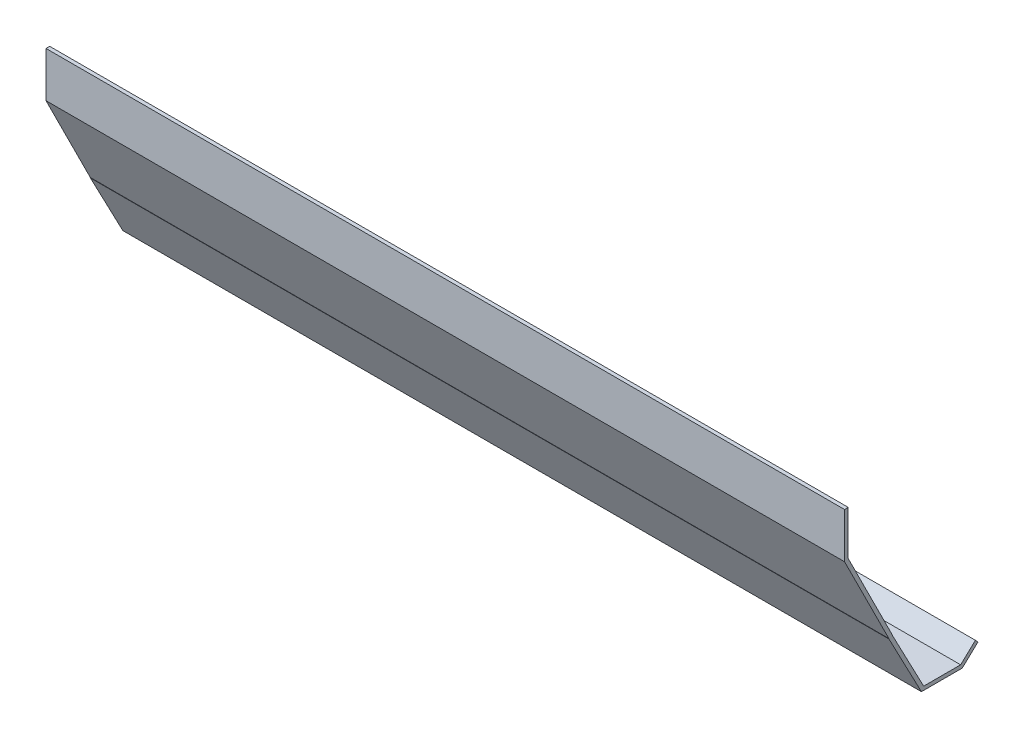
ISO-10303-21;
HEADER;
FILE_DESCRIPTION(('STEP AP214'),'2;1');
FILE_NAME('part.step','',(''),(''),'','','');
FILE_SCHEMA(('AUTOMOTIVE_DESIGN { 1 0 10303 214 1 1 1 1 }'));
ENDSEC;
DATA;
#1=APPLICATION_CONTEXT('core data for automotive mechanical design processes');
#2=APPLICATION_PROTOCOL_DEFINITION('international standard','automotive_design',2000,#1);
#3=PRODUCT_CONTEXT('',#1,'mechanical');
#4=PRODUCT('Part','Part','',(#3));
#5=PRODUCT_RELATED_PRODUCT_CATEGORY('part','',(#4));
#6=PRODUCT_DEFINITION_FORMATION('','',#4);
#7=PRODUCT_DEFINITION_CONTEXT('part definition',#1,'design');
#8=PRODUCT_DEFINITION('design','',#6,#7);
#9=PRODUCT_DEFINITION_SHAPE('','',#8);
#10=(LENGTH_UNIT() NAMED_UNIT(*) SI_UNIT(.MILLI.,.METRE.));
#11=(NAMED_UNIT(*) PLANE_ANGLE_UNIT() SI_UNIT($,.RADIAN.));
#12=(NAMED_UNIT(*) SI_UNIT($,.STERADIAN.) SOLID_ANGLE_UNIT());
#13=UNCERTAINTY_MEASURE_WITH_UNIT(LENGTH_MEASURE(1.E-05),#10,'distance_accuracy_value','');
#14=(GEOMETRIC_REPRESENTATION_CONTEXT(3) GLOBAL_UNCERTAINTY_ASSIGNED_CONTEXT((#13)) GLOBAL_UNIT_ASSIGNED_CONTEXT((#10,
#11,#12)) REPRESENTATION_CONTEXT('',''));
#15=CARTESIAN_POINT('',(0.,0.,0.));
#16=DIRECTION('',(0.,0.,1.));
#17=DIRECTION('',(1.,0.,0.));
#18=AXIS2_PLACEMENT_3D('',#15,#16,#17);
#19=CARTESIAN_POINT('',(685.8,0.,0.));
#20=DIRECTION('',(0.,-0.447213595499958,0.894427190999916));
#21=DIRECTION('',(0.,-0.894427190999916,-0.447213595499958));
#22=AXIS2_PLACEMENT_3D('',#19,#20,#21);
#23=PLANE('',#22);
#24=DIRECTION('',(0.,0.894427190999916,0.447213595499958));
#25=VECTOR('',#24,1.);
#26=CARTESIAN_POINT('',(0.,0.,0.));
#27=LINE('',#26,#25);
#28=CARTESIAN_POINT('',(0.,0.,0.));
#29=VERTEX_POINT('',#28);
#30=CARTESIAN_POINT('',(0.,76.2,38.1));
#31=VERTEX_POINT('',#30);
#32=EDGE_CURVE('E164',#29,#31,#27,.T.);
#33=ORIENTED_EDGE('',*,*,#32,.T.);
#34=DIRECTION('',(-1.,0.,0.));
#35=VECTOR('',#34,1.);
#36=CARTESIAN_POINT('',(685.8,76.2,38.1));
#37=LINE('',#36,#35);
#38=CARTESIAN_POINT('',(685.8,76.2,38.1));
#39=VERTEX_POINT('',#38);
#40=EDGE_CURVE('E11',#39,#31,#37,.T.);
#41=ORIENTED_EDGE('',*,*,#40,.F.);
#42=DIRECTION('',(0.,0.894427190999916,0.447213595499958));
#43=VECTOR('',#42,1.);
#44=CARTESIAN_POINT('',(685.8,0.,0.));
#45=LINE('',#44,#43);
#46=CARTESIAN_POINT('',(685.8,0.,0.));
#47=VERTEX_POINT('',#46);
#48=EDGE_CURVE('E190',#47,#39,#45,.T.);
#49=ORIENTED_EDGE('',*,*,#48,.F.);
#50=DIRECTION('',(-1.,0.,0.));
#51=VECTOR('',#50,1.);
#52=CARTESIAN_POINT('',(685.8,0.,0.));
#53=LINE('',#52,#51);
#54=EDGE_CURVE('E160',#47,#29,#53,.T.);
#55=ORIENTED_EDGE('',*,*,#54,.T.);
#56=EDGE_LOOP('',(#33,#41,#49,#55));
#57=FACE_BOUND('',#56,.T.);
#58=ADVANCED_FACE('F32',(#57),#23,.F.);
#59=CARTESIAN_POINT('',(685.8,76.2,38.1));
#60=DIRECTION('',(0.,0.,1.));
#61=DIRECTION('',(1.,0.,0.));
#62=AXIS2_PLACEMENT_3D('',#59,#60,#61);
#63=PLANE('',#62);
#64=DIRECTION('',(0.,1.,0.));
#65=VECTOR('',#64,1.);
#66=CARTESIAN_POINT('',(0.,76.2,38.1));
#67=LINE('',#66,#65);
#68=CARTESIAN_POINT('',(0.,114.3,38.1));
#69=VERTEX_POINT('',#68);
#70=EDGE_CURVE('E167',#31,#69,#67,.T.);
#71=ORIENTED_EDGE('',*,*,#70,.T.);
#72=DIRECTION('',(-1.,0.,0.));
#73=VECTOR('',#72,1.);
#74=CARTESIAN_POINT('',(685.8,114.3,38.1));
#75=LINE('',#74,#73);
#76=CARTESIAN_POINT('',(685.8,114.3,38.1));
#77=VERTEX_POINT('',#76);
#78=EDGE_CURVE('E40',#77,#69,#75,.T.);
#79=ORIENTED_EDGE('',*,*,#78,.F.);
#80=DIRECTION('',(0.,1.,0.));
#81=VECTOR('',#80,1.);
#82=CARTESIAN_POINT('',(685.8,76.2,38.1));
#83=LINE('',#82,#81);
#84=EDGE_CURVE('E109',#39,#77,#83,.T.);
#85=ORIENTED_EDGE('',*,*,#84,.F.);
#86=ORIENTED_EDGE('',*,*,#40,.T.);
#87=EDGE_LOOP('',(#71,#79,#85,#86));
#88=FACE_BOUND('',#87,.T.);
#89=ADVANCED_FACE('F278',(#88),#63,.F.);
#90=CARTESIAN_POINT('',(685.8,114.3,38.1));
#91=DIRECTION('',(0.,-1.,0.));
#92=DIRECTION('',(0.,0.,-1.));
#93=AXIS2_PLACEMENT_3D('',#90,#91,#92);
#94=PLANE('',#93);
#95=DIRECTION('',(0.,0.,1.));
#96=VECTOR('',#95,1.);
#97=CARTESIAN_POINT('',(0.,114.3,38.1));
#98=LINE('',#97,#96);
#99=CARTESIAN_POINT('',(0.,114.3,41.275));
#100=VERTEX_POINT('',#99);
#101=EDGE_CURVE('E169',#69,#100,#98,.T.);
#102=ORIENTED_EDGE('',*,*,#101,.T.);
#103=DIRECTION('',(-1.,0.,0.));
#104=VECTOR('',#103,1.);
#105=CARTESIAN_POINT('',(685.8,114.3,41.275));
#106=LINE('',#105,#104);
#107=CARTESIAN_POINT('',(685.8,114.3,41.275));
#108=VERTEX_POINT('',#107);
#109=EDGE_CURVE('E215',#108,#100,#106,.T.);
#110=ORIENTED_EDGE('',*,*,#109,.F.);
#111=DIRECTION('',(0.,0.,1.));
#112=VECTOR('',#111,1.);
#113=CARTESIAN_POINT('',(685.8,114.3,38.1));
#114=LINE('',#113,#112);
#115=EDGE_CURVE('E223',#77,#108,#114,.T.);
#116=ORIENTED_EDGE('',*,*,#115,.F.);
#117=ORIENTED_EDGE('',*,*,#78,.T.);
#118=EDGE_LOOP('',(#102,#110,#116,#117));
#119=FACE_BOUND('',#118,.T.);
#120=ADVANCED_FACE('F221',(#119),#94,.F.);
#121=CARTESIAN_POINT('',(685.8,114.3,41.275));
#122=DIRECTION('',(0.,0.,-1.));
#123=DIRECTION('',(-1.,0.,0.));
#124=AXIS2_PLACEMENT_3D('',#121,#122,#123);
#125=PLANE('',#124);
#126=DIRECTION('',(0.,-1.,0.));
#127=VECTOR('',#126,1.);
#128=CARTESIAN_POINT('',(0.,114.3,41.275));
#129=LINE('',#128,#127);
#130=CARTESIAN_POINT('',(0.,75.4504841714382,41.275));
#131=VERTEX_POINT('',#130);
#132=EDGE_CURVE('E171',#100,#131,#129,.T.);
#133=ORIENTED_EDGE('',*,*,#132,.T.);
#134=DIRECTION('',(-1.,0.,0.));
#135=VECTOR('',#134,1.);
#136=CARTESIAN_POINT('',(685.8,75.4504841714382,41.275));
#137=LINE('',#136,#135);
#138=CARTESIAN_POINT('',(685.8,75.4504841714382,41.275));
#139=VERTEX_POINT('',#138);
#140=EDGE_CURVE('E212',#139,#131,#137,.T.);
#141=ORIENTED_EDGE('',*,*,#140,.F.);
#142=DIRECTION('',(0.,-1.,0.));
#143=VECTOR('',#142,1.);
#144=CARTESIAN_POINT('',(685.8,114.3,41.275));
#145=LINE('',#144,#143);
#146=EDGE_CURVE('E241',#108,#139,#145,.T.);
#147=ORIENTED_EDGE('',*,*,#146,.F.);
#148=ORIENTED_EDGE('',*,*,#109,.T.);
#149=EDGE_LOOP('',(#133,#141,#147,#148));
#150=FACE_BOUND('',#149,.T.);
#151=ADVANCED_FACE('F232',(#150),#125,.F.);
#152=CARTESIAN_POINT('',(685.8,75.4504841714382,41.275));
#153=DIRECTION('',(0.,0.447213595499958,-0.894427190999916));
#154=DIRECTION('',(0.,0.894427190999916,0.447213595499958));
#155=AXIS2_PLACEMENT_3D('',#152,#153,#154);
#156=PLANE('',#155);
#157=DIRECTION('',(0.,-0.894427190999916,-0.447213595499958));
#158=VECTOR('',#157,1.);
#159=CARTESIAN_POINT('',(0.,75.4504841714382,41.275));
#160=LINE('',#159,#158);
#161=CARTESIAN_POINT('',(0.,-0.749515828561824,3.17499999999998));
#162=VERTEX_POINT('',#161);
#163=EDGE_CURVE('E173',#131,#162,#160,.T.);
#164=ORIENTED_EDGE('',*,*,#163,.T.);
#165=DIRECTION('',(-1.,0.,0.));
#166=VECTOR('',#165,1.);
#167=CARTESIAN_POINT('',(685.8,-0.749515828561824,3.17499999999998));
#168=LINE('',#167,#166);
#169=CARTESIAN_POINT('',(685.8,-0.749515828561824,3.17499999999998));
#170=VERTEX_POINT('',#169);
#171=EDGE_CURVE('E209',#170,#162,#168,.T.);
#172=ORIENTED_EDGE('',*,*,#171,.F.);
#173=DIRECTION('',(0.,-0.894427190999916,-0.447213595499958));
#174=VECTOR('',#173,1.);
#175=CARTESIAN_POINT('',(685.8,75.4504841714382,41.275));
#176=LINE('',#175,#174);
#177=EDGE_CURVE('E238',#139,#170,#176,.T.);
#178=ORIENTED_EDGE('',*,*,#177,.F.);
#179=ORIENTED_EDGE('',*,*,#140,.T.);
#180=EDGE_LOOP('',(#164,#172,#178,#179));
#181=FACE_BOUND('',#180,.T.);
#182=ADVANCED_FACE('F236',(#181),#156,.F.);
#183=CARTESIAN_POINT('',(685.8,-0.749515828561824,3.17499999999998));
#184=DIRECTION('',(0.,0.,-1.));
#185=DIRECTION('',(0.,1.,0.));
#186=AXIS2_PLACEMENT_3D('',#183,#184,#185);
#187=PLANE('',#186);
#188=DIRECTION('',(0.,-1.,0.));
#189=VECTOR('',#188,1.);
#190=CARTESIAN_POINT('',(0.,-0.749515828561824,3.17499999999998));
#191=LINE('',#190,#189);
#192=CARTESIAN_POINT('',(0.,-1.03677780359869,3.17499999999999));
#193=VERTEX_POINT('',#192);
#194=EDGE_CURVE('E175',#162,#193,#191,.T.);
#195=ORIENTED_EDGE('',*,*,#194,.T.);
#196=DIRECTION('',(-1.,0.,0.));
#197=VECTOR('',#196,1.);
#198=CARTESIAN_POINT('',(685.8,-1.03677780359869,3.17499999999999));
#199=LINE('',#198,#197);
#200=CARTESIAN_POINT('',(685.8,-1.03677780359869,3.17499999999999));
#201=VERTEX_POINT('',#200);
#202=EDGE_CURVE('E206',#201,#193,#199,.T.);
#203=ORIENTED_EDGE('',*,*,#202,.F.);
#204=DIRECTION('',(0.,-1.,0.));
#205=VECTOR('',#204,1.);
#206=CARTESIAN_POINT('',(685.8,-0.749515828561824,3.17499999999998));
#207=LINE('',#206,#205);
#208=EDGE_CURVE('E240',#170,#201,#207,.T.);
#209=ORIENTED_EDGE('',*,*,#208,.F.);
#210=ORIENTED_EDGE('',*,*,#171,.T.);
#211=EDGE_LOOP('',(#195,#203,#209,#210));
#212=FACE_BOUND('',#211,.T.);
#213=ADVANCED_FACE('F291',(#212),#187,.F.);
#214=CARTESIAN_POINT('',(685.8,-1.03677780359869,3.17499999999999));
#215=DIRECTION('',(0.,0.46483389898992,-0.885397902837944));
#216=DIRECTION('',(0.,0.885397902837944,0.46483389898992));
#217=AXIS2_PLACEMENT_3D('',#214,#215,#216);
#218=PLANE('',#217);
#219=DIRECTION('',(0.,-0.885397902837943,-0.46483389898992));
#220=VECTOR('',#219,1.);
#221=CARTESIAN_POINT('',(0.,-1.03677780359869,3.17499999999999));
#222=LINE('',#221,#220);
#223=CARTESIAN_POINT('',(0.,-54.229,-24.7509166531107));
#224=VERTEX_POINT('',#223);
#225=EDGE_CURVE('E177',#193,#224,#222,.T.);
#226=ORIENTED_EDGE('',*,*,#225,.T.);
#227=DIRECTION('',(-1.,0.,0.));
#228=VECTOR('',#227,1.);
#229=CARTESIAN_POINT('',(685.8,-54.229,-24.7509166531107));
#230=LINE('',#229,#228);
#231=CARTESIAN_POINT('',(685.8,-54.229,-24.7509166531107));
#232=VERTEX_POINT('',#231);
#233=EDGE_CURVE('E203',#232,#224,#230,.T.);
#234=ORIENTED_EDGE('',*,*,#233,.F.);
#235=DIRECTION('',(0.,-0.885397902837943,-0.46483389898992));
#236=VECTOR('',#235,1.);
#237=CARTESIAN_POINT('',(685.8,-1.03677780359869,3.17499999999999));
#238=LINE('',#237,#236);
#239=EDGE_CURVE('E243',#201,#232,#238,.T.);
#240=ORIENTED_EDGE('',*,*,#239,.F.);
#241=ORIENTED_EDGE('',*,*,#202,.T.);
#242=EDGE_LOOP('',(#226,#234,#240,#241));
#243=FACE_BOUND('',#242,.T.);
#244=ADVANCED_FACE('F294',(#243),#218,.F.);
#245=CARTESIAN_POINT('',(685.8,-54.229,-24.7509166531107));
#246=DIRECTION('',(0.,1.,0.));
#247=DIRECTION('',(0.,0.,1.));
#248=AXIS2_PLACEMENT_3D('',#245,#246,#247);
#249=PLANE('',#248);
#250=DIRECTION('',(0.,0.,-1.));
#251=VECTOR('',#250,1.);
#252=CARTESIAN_POINT('',(0.,-54.229,-24.7509166531107));
#253=LINE('',#252,#251);
#254=CARTESIAN_POINT('',(0.,-54.229,-59.7737240911878));
#255=VERTEX_POINT('',#254);
#256=EDGE_CURVE('E179',#224,#255,#253,.T.);
#257=ORIENTED_EDGE('',*,*,#256,.T.);
#258=DIRECTION('',(-1.,0.,0.));
#259=VECTOR('',#258,1.);
#260=CARTESIAN_POINT('',(685.8,-54.229,-59.7737240911878));
#261=LINE('',#260,#259);
#262=CARTESIAN_POINT('',(685.8,-54.229,-59.7737240911878));
#263=VERTEX_POINT('',#262);
#264=EDGE_CURVE('E200',#263,#255,#261,.T.);
#265=ORIENTED_EDGE('',*,*,#264,.F.);
#266=DIRECTION('',(0.,0.,-1.));
#267=VECTOR('',#266,1.);
#268=CARTESIAN_POINT('',(685.8,-54.229,-24.7509166531107));
#269=LINE('',#268,#267);
#270=EDGE_CURVE('E249',#232,#263,#269,.T.);
#271=ORIENTED_EDGE('',*,*,#270,.F.);
#272=ORIENTED_EDGE('',*,*,#233,.T.);
#273=EDGE_LOOP('',(#257,#265,#271,#272));
#274=FACE_BOUND('',#273,.T.);
#275=ADVANCED_FACE('F298',(#274),#249,.F.);
#276=CARTESIAN_POINT('',(685.8,-54.229,-59.7737240911878));
#277=DIRECTION('',(0.,0.729942991089569,0.683508031963936));
#278=DIRECTION('',(0.,-0.683508031963936,0.729942991089569));
#279=AXIS2_PLACEMENT_3D('',#276,#277,#278);
#280=PLANE('',#279);
#281=DIRECTION('',(0.,0.683508031963936,-0.729942991089569));
#282=VECTOR('',#281,1.);
#283=CARTESIAN_POINT('',(0.,-54.229,-59.7737240911878));
#284=LINE('',#283,#282);
#285=CARTESIAN_POINT('',(0.,-41.529,-73.3365142170055));
#286=VERTEX_POINT('',#285);
#287=EDGE_CURVE('E181',#255,#286,#284,.T.);
#288=ORIENTED_EDGE('',*,*,#287,.T.);
#289=DIRECTION('',(-1.,0.,0.));
#290=VECTOR('',#289,1.);
#291=CARTESIAN_POINT('',(685.8,-41.529,-73.3365142170055));
#292=LINE('',#291,#290);
#293=CARTESIAN_POINT('',(685.8,-41.529,-73.3365142170055));
#294=VERTEX_POINT('',#293);
#295=EDGE_CURVE('E197',#294,#286,#292,.T.);
#296=ORIENTED_EDGE('',*,*,#295,.F.);
#297=DIRECTION('',(0.,0.683508031963936,-0.729942991089569));
#298=VECTOR('',#297,1.);
#299=CARTESIAN_POINT('',(685.8,-54.229,-59.7737240911878));
#300=LINE('',#299,#298);
#301=EDGE_CURVE('E251',#263,#294,#300,.T.);
#302=ORIENTED_EDGE('',*,*,#301,.F.);
#303=ORIENTED_EDGE('',*,*,#264,.T.);
#304=EDGE_LOOP('',(#288,#296,#302,#303));
#305=FACE_BOUND('',#304,.T.);
#306=ADVANCED_FACE('F302',(#305),#280,.F.);
#307=CARTESIAN_POINT('',(685.8,-41.529,-73.3365142170055));
#308=DIRECTION('',(0.,-0.683508031963937,0.729942991089568));
#309=DIRECTION('',(0.,-0.729942991089568,-0.683508031963937));
#310=AXIS2_PLACEMENT_3D('',#307,#308,#309);
#311=PLANE('',#310);
#312=DIRECTION('',(0.,0.729942991089568,0.683508031963937));
#313=VECTOR('',#312,1.);
#314=CARTESIAN_POINT('',(0.,-41.529,-73.3365142170055));
#315=LINE('',#314,#313);
#316=CARTESIAN_POINT('',(0.,-39.161904162509,-71.12));
#317=VERTEX_POINT('',#316);
#318=EDGE_CURVE('E183',#286,#317,#315,.T.);
#319=ORIENTED_EDGE('',*,*,#318,.T.);
#320=DIRECTION('',(-1.,0.,0.));
#321=VECTOR('',#320,1.);
#322=CARTESIAN_POINT('',(685.8,-39.161904162509,-71.12));
#323=LINE('',#322,#321);
#324=CARTESIAN_POINT('',(685.8,-39.161904162509,-71.12));
#325=VERTEX_POINT('',#324);
#326=EDGE_CURVE('E194',#325,#317,#323,.T.);
#327=ORIENTED_EDGE('',*,*,#326,.F.);
#328=DIRECTION('',(0.,0.729942991089568,0.683508031963937));
#329=VECTOR('',#328,1.);
#330=CARTESIAN_POINT('',(685.8,-41.529,-73.3365142170055));
#331=LINE('',#330,#329);
#332=EDGE_CURVE('E253',#294,#325,#331,.T.);
#333=ORIENTED_EDGE('',*,*,#332,.F.);
#334=ORIENTED_EDGE('',*,*,#295,.T.);
#335=EDGE_LOOP('',(#319,#327,#333,#334));
#336=FACE_BOUND('',#335,.T.);
#337=ADVANCED_FACE('F259',(#336),#311,.F.);
#338=CARTESIAN_POINT('',(685.8,-39.161904162509,-71.12));
#339=DIRECTION('',(0.,-0.729942991089569,-0.683508031963936));
#340=DIRECTION('',(0.,0.683508031963936,-0.729942991089569));
#341=AXIS2_PLACEMENT_3D('',#338,#339,#340);
#342=PLANE('',#341);
#343=DIRECTION('',(0.,-0.683508031963936,0.729942991089569));
#344=VECTOR('',#343,1.);
#345=CARTESIAN_POINT('',(0.,-39.161904162509,-71.12));
#346=LINE('',#345,#344);
#347=CARTESIAN_POINT('',(0.,-51.054,-58.42));
#348=VERTEX_POINT('',#347);
#349=EDGE_CURVE('E185',#317,#348,#346,.T.);
#350=ORIENTED_EDGE('',*,*,#349,.T.);
#351=DIRECTION('',(-1.,0.,0.));
#352=VECTOR('',#351,1.);
#353=CARTESIAN_POINT('',(685.8,-51.054,-58.42));
#354=LINE('',#353,#352);
#355=CARTESIAN_POINT('',(685.8,-51.054,-58.42));
#356=VERTEX_POINT('',#355);
#357=EDGE_CURVE('E155',#356,#348,#354,.T.);
#358=ORIENTED_EDGE('',*,*,#357,.F.);
#359=DIRECTION('',(0.,-0.683508031963936,0.729942991089569));
#360=VECTOR('',#359,1.);
#361=CARTESIAN_POINT('',(685.8,-39.161904162509,-71.12));
#362=LINE('',#361,#360);
#363=EDGE_CURVE('E146',#325,#356,#362,.T.);
#364=ORIENTED_EDGE('',*,*,#363,.F.);
#365=ORIENTED_EDGE('',*,*,#326,.T.);
#366=EDGE_LOOP('',(#350,#358,#364,#365));
#367=FACE_BOUND('',#366,.T.);
#368=ADVANCED_FACE('F263',(#367),#342,.F.);
#369=CARTESIAN_POINT('',(685.8,-51.054,-58.42));
#370=DIRECTION('',(0.,-1.,0.));
#371=DIRECTION('',(0.,0.,-1.));
#372=AXIS2_PLACEMENT_3D('',#369,#370,#371);
#373=PLANE('',#372);
#374=DIRECTION('',(0.,0.,1.));
#375=VECTOR('',#374,1.);
#376=CARTESIAN_POINT('',(0.,-51.054,-58.42));
#377=LINE('',#376,#375);
#378=CARTESIAN_POINT('',(0.,-51.054,-26.67));
#379=VERTEX_POINT('',#378);
#380=EDGE_CURVE('E154',#348,#379,#377,.T.);
#381=ORIENTED_EDGE('',*,*,#380,.T.);
#382=DIRECTION('',(-1.,0.,0.));
#383=VECTOR('',#382,1.);
#384=CARTESIAN_POINT('',(685.8,-51.054,-26.67));
#385=LINE('',#384,#383);
#386=CARTESIAN_POINT('',(685.8,-51.054,-26.67));
#387=VERTEX_POINT('',#386);
#388=EDGE_CURVE('E151',#387,#379,#385,.T.);
#389=ORIENTED_EDGE('',*,*,#388,.F.);
#390=DIRECTION('',(0.,0.,1.));
#391=VECTOR('',#390,1.);
#392=CARTESIAN_POINT('',(685.8,-51.054,-58.42));
#393=LINE('',#392,#391);
#394=EDGE_CURVE('E140',#356,#387,#393,.T.);
#395=ORIENTED_EDGE('',*,*,#394,.F.);
#396=ORIENTED_EDGE('',*,*,#357,.T.);
#397=EDGE_LOOP('',(#381,#389,#395,#396));
#398=FACE_BOUND('',#397,.T.);
#399=ADVANCED_FACE('F152',(#398),#373,.F.);
#400=CARTESIAN_POINT('',(685.8,-51.054,-26.67));
#401=DIRECTION('',(0.,-0.46483389898992,0.885397902837944));
#402=DIRECTION('',(0.,-0.885397902837944,-0.46483389898992));
#403=AXIS2_PLACEMENT_3D('',#400,#401,#402);
#404=PLANE('',#403);
#405=DIRECTION('',(0.,0.885397902837944,0.46483389898992));
#406=VECTOR('',#405,1.);
#407=CARTESIAN_POINT('',(0.,-51.054,-26.67));
#408=LINE('',#407,#406);
#409=CARTESIAN_POINT('',(0.,-0.254000000000001,0.));
#410=VERTEX_POINT('',#409);
#411=EDGE_CURVE('E95',#379,#410,#408,.T.);
#412=ORIENTED_EDGE('',*,*,#411,.T.);
#413=DIRECTION('',(-1.,0.,0.));
#414=VECTOR('',#413,1.);
#415=CARTESIAN_POINT('',(685.8,-0.254000000000001,0.));
#416=LINE('',#415,#414);
#417=CARTESIAN_POINT('',(685.8,-0.254000000000001,0.));
#418=VERTEX_POINT('',#417);
#419=EDGE_CURVE('E156',#418,#410,#416,.T.);
#420=ORIENTED_EDGE('',*,*,#419,.F.);
#421=DIRECTION('',(0.,0.885397902837944,0.46483389898992));
#422=VECTOR('',#421,1.);
#423=CARTESIAN_POINT('',(685.8,-51.054,-26.67));
#424=LINE('',#423,#422);
#425=EDGE_CURVE('E144',#387,#418,#424,.T.);
#426=ORIENTED_EDGE('',*,*,#425,.F.);
#427=ORIENTED_EDGE('',*,*,#388,.T.);
#428=EDGE_LOOP('',(#412,#420,#426,#427));
#429=FACE_BOUND('',#428,.T.);
#430=ADVANCED_FACE('F158',(#429),#404,.F.);
#431=CARTESIAN_POINT('',(685.8,-0.254000000000001,0.));
#432=DIRECTION('',(0.,0.,1.));
#433=DIRECTION('',(1.,0.,0.));
#434=AXIS2_PLACEMENT_3D('',#431,#432,#433);
#435=PLANE('',#434);
#436=DIRECTION('',(0.,1.,0.));
#437=VECTOR('',#436,1.);
#438=CARTESIAN_POINT('',(0.,-0.254000000000001,0.));
#439=LINE('',#438,#437);
#440=EDGE_CURVE('E101',#410,#29,#439,.T.);
#441=ORIENTED_EDGE('',*,*,#440,.T.);
#442=ORIENTED_EDGE('',*,*,#54,.F.);
#443=DIRECTION('',(0.,1.,0.));
#444=VECTOR('',#443,1.);
#445=CARTESIAN_POINT('',(685.8,-0.254000000000001,0.));
#446=LINE('',#445,#444);
#447=EDGE_CURVE('E48',#418,#47,#446,.T.);
#448=ORIENTED_EDGE('',*,*,#447,.F.);
#449=ORIENTED_EDGE('',*,*,#419,.T.);
#450=EDGE_LOOP('',(#441,#442,#448,#449));
#451=FACE_BOUND('',#450,.T.);
#452=ADVANCED_FACE('F267',(#451),#435,.F.);
#453=CARTESIAN_POINT('',(685.8,0.,0.));
#454=DIRECTION('',(-1.,0.,0.));
#455=DIRECTION('',(0.,0.,1.));
#456=AXIS2_PLACEMENT_3D('',#453,#454,#455);
#457=PLANE('',#456);
#458=ORIENTED_EDGE('',*,*,#48,.T.);
#459=ORIENTED_EDGE('',*,*,#84,.T.);
#460=ORIENTED_EDGE('',*,*,#115,.T.);
#461=ORIENTED_EDGE('',*,*,#146,.T.);
#462=ORIENTED_EDGE('',*,*,#177,.T.);
#463=ORIENTED_EDGE('',*,*,#208,.T.);
#464=ORIENTED_EDGE('',*,*,#239,.T.);
#465=ORIENTED_EDGE('',*,*,#270,.T.);
#466=ORIENTED_EDGE('',*,*,#301,.T.);
#467=ORIENTED_EDGE('',*,*,#332,.T.);
#468=ORIENTED_EDGE('',*,*,#363,.T.);
#469=ORIENTED_EDGE('',*,*,#394,.T.);
#470=ORIENTED_EDGE('',*,*,#425,.T.);
#471=ORIENTED_EDGE('',*,*,#447,.T.);
#472=EDGE_LOOP('',(#458,#459,#460,#461,#462,#463,#464,#465,#466,#467,#468,#469,#470,#471));
#473=FACE_BOUND('',#472,.T.);
#474=ADVANCED_FACE('F142',(#473),#457,.F.);
#475=CARTESIAN_POINT('',(0.,0.,0.));
#476=DIRECTION('',(-1.,0.,0.));
#477=DIRECTION('',(0.,0.,1.));
#478=AXIS2_PLACEMENT_3D('',#475,#476,#477);
#479=PLANE('',#478);
#480=ORIENTED_EDGE('',*,*,#32,.F.);
#481=ORIENTED_EDGE('',*,*,#440,.F.);
#482=ORIENTED_EDGE('',*,*,#411,.F.);
#483=ORIENTED_EDGE('',*,*,#380,.F.);
#484=ORIENTED_EDGE('',*,*,#349,.F.);
#485=ORIENTED_EDGE('',*,*,#318,.F.);
#486=ORIENTED_EDGE('',*,*,#287,.F.);
#487=ORIENTED_EDGE('',*,*,#256,.F.);
#488=ORIENTED_EDGE('',*,*,#225,.F.);
#489=ORIENTED_EDGE('',*,*,#194,.F.);
#490=ORIENTED_EDGE('',*,*,#163,.F.);
#491=ORIENTED_EDGE('',*,*,#132,.F.);
#492=ORIENTED_EDGE('',*,*,#101,.F.);
#493=ORIENTED_EDGE('',*,*,#70,.F.);
#494=EDGE_LOOP('',(#480,#481,#482,#483,#484,#485,#486,#487,#488,#489,#490,#491,#492,#493));
#495=FACE_BOUND('',#494,.T.);
#496=ADVANCED_FACE('F227',(#495),#479,.T.);
#497=CLOSED_SHELL('',(#58,#89,#120,#151,#182,#213,#244,#275,#306,#337,#368,#399,#430,#452,#474,#496));
#498=MANIFOLD_SOLID_BREP('B2',#497);
#499=ADVANCED_BREP_SHAPE_REPRESENTATION('',(#18,#498),#14);
#500=SHAPE_DEFINITION_REPRESENTATION(#9,#499);
ENDSEC;
END-ISO-10303-21;
